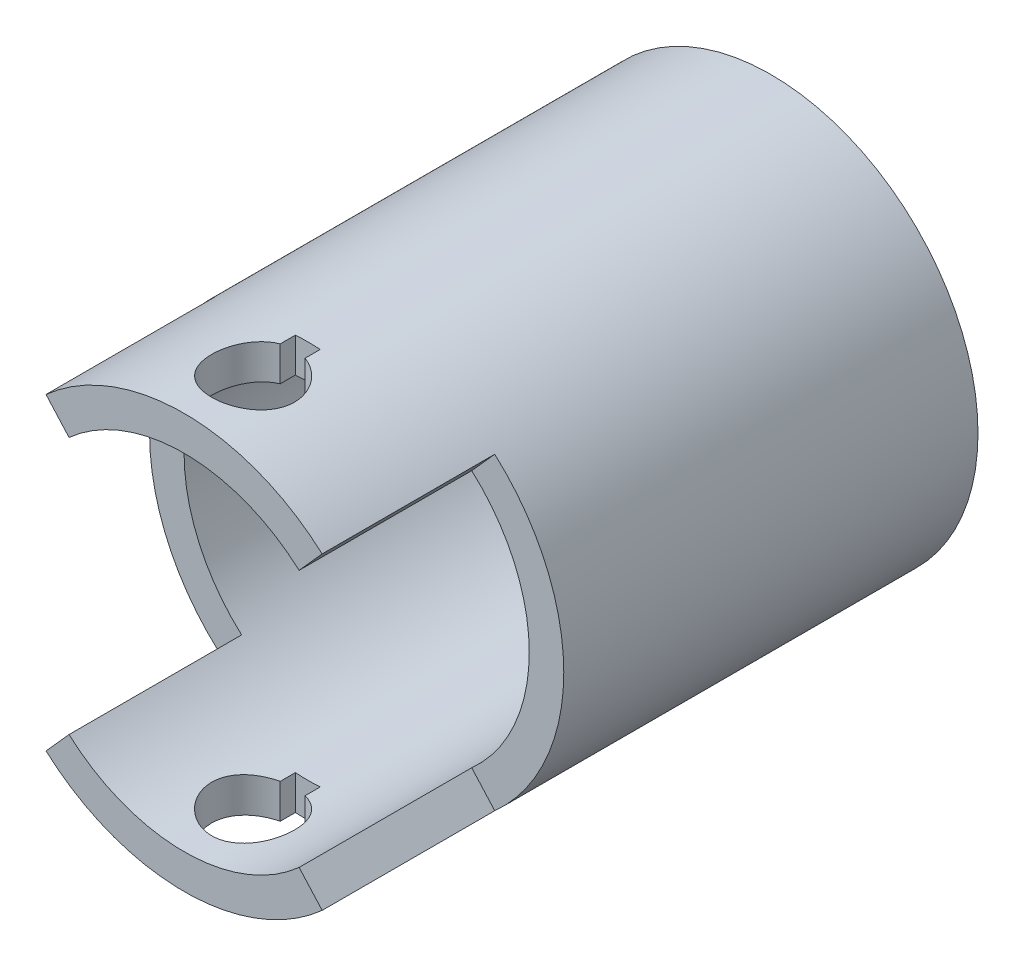
ISO-10303-21;
HEADER;
FILE_DESCRIPTION(('STEP AP214'),'2;1');
FILE_NAME('part.step','',(''),(''),'','','');
FILE_SCHEMA(('AUTOMOTIVE_DESIGN { 1 0 10303 214 1 1 1 1 }'));
ENDSEC;
DATA;
#1=APPLICATION_CONTEXT('core data for automotive mechanical design processes');
#2=APPLICATION_PROTOCOL_DEFINITION('international standard','automotive_design',2000,#1);
#3=PRODUCT_CONTEXT('',#1,'mechanical');
#4=PRODUCT('Part','Part','',(#3));
#5=PRODUCT_RELATED_PRODUCT_CATEGORY('part','',(#4));
#6=PRODUCT_DEFINITION_FORMATION('','',#4);
#7=PRODUCT_DEFINITION_CONTEXT('part definition',#1,'design');
#8=PRODUCT_DEFINITION('design','',#6,#7);
#9=PRODUCT_DEFINITION_SHAPE('','',#8);
#10=(LENGTH_UNIT() NAMED_UNIT(*) SI_UNIT(.MILLI.,.METRE.));
#11=(NAMED_UNIT(*) PLANE_ANGLE_UNIT() SI_UNIT($,.RADIAN.));
#12=(NAMED_UNIT(*) SI_UNIT($,.STERADIAN.) SOLID_ANGLE_UNIT());
#13=UNCERTAINTY_MEASURE_WITH_UNIT(LENGTH_MEASURE(1.E-05),#10,'distance_accuracy_value','');
#14=(GEOMETRIC_REPRESENTATION_CONTEXT(3) GLOBAL_UNCERTAINTY_ASSIGNED_CONTEXT((#13)) GLOBAL_UNIT_ASSIGNED_CONTEXT((#10,
#11,#12)) REPRESENTATION_CONTEXT('',''));
#15=CARTESIAN_POINT('',(0.,0.,0.));
#16=DIRECTION('',(0.,0.,1.));
#17=DIRECTION('',(1.,0.,0.));
#18=AXIS2_PLACEMENT_3D('',#15,#16,#17);
#19=CARTESIAN_POINT('',(0.,0.,30.));
#20=DIRECTION('',(0.,0.,1.));
#21=DIRECTION('',(1.,0.,0.));
#22=AXIS2_PLACEMENT_3D('',#19,#20,#21);
#23=PLANE('',#22);
#24=DIRECTION('',(0.666666666666667,0.74535599249993,0.));
#25=VECTOR('',#24,1.);
#26=CARTESIAN_POINT('',(10.,11.1803398874989,30.));
#27=LINE('',#26,#25);
#28=CARTESIAN_POINT('',(8.33333333333334,9.31694990624912,30.));
#29=VERTEX_POINT('',#28);
#30=CARTESIAN_POINT('',(10.,11.180339887499,30.));
#31=VERTEX_POINT('',#30);
#32=EDGE_CURVE('E200',#29,#31,#27,.T.);
#33=ORIENTED_EDGE('',*,*,#32,.F.);
#34=CARTESIAN_POINT('',(0.,0.,30.));
#35=DIRECTION('',(0.,0.,1.));
#36=DIRECTION('',(1.,0.,0.));
#37=AXIS2_PLACEMENT_3D('',#34,#35,#36);
#38=CIRCLE('',#37,12.5);
#39=CARTESIAN_POINT('',(8.33333333333333,-9.31694990624912,30.));
#40=VERTEX_POINT('',#39);
#41=EDGE_CURVE('E265',#40,#29,#38,.T.);
#42=ORIENTED_EDGE('',*,*,#41,.F.);
#43=DIRECTION('',(-0.666666666666667,0.74535599249993,0.));
#44=VECTOR('',#43,1.);
#45=CARTESIAN_POINT('',(10.,-11.1803398874989,30.));
#46=LINE('',#45,#44);
#47=CARTESIAN_POINT('',(10.,-11.180339887499,30.));
#48=VERTEX_POINT('',#47);
#49=EDGE_CURVE('E214',#48,#40,#46,.T.);
#50=ORIENTED_EDGE('',*,*,#49,.F.);
#51=CARTESIAN_POINT('',(0.,0.,30.));
#52=DIRECTION('',(0.,0.,1.));
#53=DIRECTION('',(1.,0.,0.));
#54=AXIS2_PLACEMENT_3D('',#51,#52,#53);
#55=CIRCLE('',#54,15.);
#56=EDGE_CURVE('E273',#48,#31,#55,.T.);
#57=ORIENTED_EDGE('',*,*,#56,.T.);
#58=EDGE_LOOP('',(#33,#42,#50,#57));
#59=FACE_BOUND('',#58,.T.);
#60=ADVANCED_FACE('F47',(#59),#23,.T.);
#61=DIRECTION('',(0.666666666666666,-0.74535599249993,0.));
#62=VECTOR('',#61,1.);
#63=CARTESIAN_POINT('',(-10.,11.1803398874989,30.));
#64=LINE('',#63,#62);
#65=CARTESIAN_POINT('',(-10.,11.1803398874989,30.));
#66=VERTEX_POINT('',#65);
#67=CARTESIAN_POINT('',(-8.33333333333334,9.31694990624912,30.));
#68=VERTEX_POINT('',#67);
#69=EDGE_CURVE('E210',#66,#68,#64,.T.);
#70=ORIENTED_EDGE('',*,*,#69,.F.);
#71=CARTESIAN_POINT('',(-10.,-11.1803398874989,30.));
#72=VERTEX_POINT('',#71);
#73=EDGE_CURVE('E276',#66,#72,#55,.T.);
#74=ORIENTED_EDGE('',*,*,#73,.T.);
#75=DIRECTION('',(-0.666666666666666,-0.74535599249993,0.));
#76=VECTOR('',#75,1.);
#77=CARTESIAN_POINT('',(-10.,-11.1803398874989,30.));
#78=LINE('',#77,#76);
#79=CARTESIAN_POINT('',(-8.33333333333334,-9.31694990624912,30.));
#80=VERTEX_POINT('',#79);
#81=EDGE_CURVE('E246',#80,#72,#78,.T.);
#82=ORIENTED_EDGE('',*,*,#81,.F.);
#83=EDGE_CURVE('E269',#68,#80,#38,.T.);
#84=ORIENTED_EDGE('',*,*,#83,.F.);
#85=EDGE_LOOP('',(#70,#74,#82,#84));
#86=FACE_BOUND('',#85,.T.);
#87=ADVANCED_FACE('F397',(#86),#23,.T.);
#88=CARTESIAN_POINT('',(0.,0.,0.));
#89=DIRECTION('',(0.,0.,1.));
#90=DIRECTION('',(1.,0.,0.));
#91=AXIS2_PLACEMENT_3D('',#88,#89,#90);
#92=PLANE('',#91);
#93=CARTESIAN_POINT('',(0.,0.,0.));
#94=DIRECTION('',(0.,0.,1.));
#95=DIRECTION('',(1.,0.,0.));
#96=AXIS2_PLACEMENT_3D('',#93,#94,#95);
#97=CIRCLE('',#96,15.);
#98=CARTESIAN_POINT('',(15.,0.,0.));
#99=VERTEX_POINT('',#98);
#100=EDGE_CURVE('E277',#99,#99,#97,.T.);
#101=ORIENTED_EDGE('',*,*,#100,.F.);
#102=EDGE_LOOP('',(#101));
#103=FACE_BOUND('',#102,.T.);
#104=CARTESIAN_POINT('',(0.,0.,0.));
#105=DIRECTION('',(0.,0.,1.));
#106=DIRECTION('',(1.,0.,0.));
#107=AXIS2_PLACEMENT_3D('',#104,#105,#106);
#108=CIRCLE('',#107,12.5);
#109=CARTESIAN_POINT('',(12.5,0.,0.));
#110=VERTEX_POINT('',#109);
#111=EDGE_CURVE('E232',#110,#110,#108,.T.);
#112=ORIENTED_EDGE('',*,*,#111,.T.);
#113=EDGE_LOOP('',(#112));
#114=FACE_BOUND('',#113,.T.);
#115=ADVANCED_FACE('F403',(#103,#114),#92,.F.);
#116=CARTESIAN_POINT('',(0.,0.,30.));
#117=DIRECTION('',(0.,0.,-1.));
#118=DIRECTION('',(-1.,0.,0.));
#119=AXIS2_PLACEMENT_3D('',#116,#117,#118);
#120=CYLINDRICAL_SURFACE('',#119,15.);
#121=CARTESIAN_POINT('',(-0.899999999999991,-14.9729756561613,34.6381823957492));
#122=CARTESIAN_POINT('',(-0.980655268019573,-14.9681328049606,34.6635388645008));
#123=CARTESIAN_POINT('',(-1.06019389196661,-14.9626926987928,34.6923076292037));
#124=CARTESIAN_POINT('',(-1.21648823193344,-14.9507945355664,34.7564115717083));
#125=CARTESIAN_POINT('',(-1.29324433924086,-14.9443366223238,34.7917458219331));
#126=CARTESIAN_POINT('',(-1.44337212889856,-14.9305848050696,34.8686914325859));
#127=CARTESIAN_POINT('',(-1.51674711344037,-14.9232917420677,34.9102964913302));
#128=CARTESIAN_POINT('',(-1.65967459235491,-14.9080733817031,34.9994829685327));
#129=CARTESIAN_POINT('',(-1.72922703092511,-14.9001480751149,35.0470644742032));
#130=CARTESIAN_POINT('',(-1.93144019722686,-14.8757493328797,35.1983028052586));
#131=CARTESIAN_POINT('',(-2.05778247693432,-14.8586409995706,35.3105180648826));
#132=CARTESIAN_POINT('',(-2.28983159190748,-14.8246582090057,35.5544786815639));
#133=CARTESIAN_POINT('',(-2.39553880470616,-14.8077837474764,35.6862236812333));
#134=CARTESIAN_POINT('',(-2.58413515889965,-14.7760437239309,35.9667107068343));
#135=CARTESIAN_POINT('',(-2.66686573140919,-14.7611924659785,36.1155612909484));
#136=CARTESIAN_POINT('',(-2.80607734841753,-14.7353648594891,36.4253953899722));
#137=CARTESIAN_POINT('',(-2.86255825369075,-14.7243885315045,36.5863789692288));
#138=CARTESIAN_POINT('',(-2.94698380971086,-14.7077235383515,36.9138793193003));
#139=CARTESIAN_POINT('',(-2.97526076417683,-14.7019733711604,37.0803071999752));
#140=CARTESIAN_POINT('',(-3.00352852726525,-14.6962251913254,37.4156306902891));
#141=CARTESIAN_POINT('',(-3.00352367707613,-14.6962262958752,37.5845259172163));
#142=CARTESIAN_POINT('',(-2.97546739984133,-14.7019312346246,37.9171440045459));
#143=CARTESIAN_POINT('',(-2.94786291338032,-14.7075441920595,38.0809063998905));
#144=CARTESIAN_POINT('',(-2.86614622279458,-14.7236857824962,38.4014220943643));
#145=CARTESIAN_POINT('',(-2.81203259322414,-14.7342146798358,38.5581750160865));
#146=CARTESIAN_POINT('',(-2.6785694888077,-14.7590606321949,38.8611822422004));
#147=CARTESIAN_POINT('',(-2.59909054625977,-14.7733970568806,39.0073778604002));
#148=CARTESIAN_POINT('',(-2.41723368105998,-14.8042379272796,39.2845047693255));
#149=CARTESIAN_POINT('',(-2.31485322422644,-14.8207426128398,39.415434368339));
#150=CARTESIAN_POINT('',(-2.0878910562565,-14.8544296011563,39.660820252272));
#151=CARTESIAN_POINT('',(-1.96293979842515,-14.8716187670055,39.7749340474476));
#152=CARTESIAN_POINT('',(-1.69552471037375,-14.9044729416879,39.9806560776456));
#153=CARTESIAN_POINT('',(-1.55306043299695,-14.9201379115857,40.0722637378437));
#154=CARTESIAN_POINT('',(-1.25402233574952,-14.9482448093784,40.2305927173542));
#155=CARTESIAN_POINT('',(-1.09740525398656,-14.9606763713043,40.2972342914875));
#156=CARTESIAN_POINT('',(-0.774893396556592,-14.9808415891407,40.4031602356551));
#157=CARTESIAN_POINT('',(-0.608999718554731,-14.9885757995922,40.4424478350148));
#158=CARTESIAN_POINT('',(-0.275519001636917,-14.998381934318,40.4919968856149));
#159=CARTESIAN_POINT('',(-0.108002833765448,-15.0005434823916,40.502717862776));
#160=CARTESIAN_POINT('',(0.226445623401845,-14.999222705133,40.4961129654795));
#161=CARTESIAN_POINT('',(0.393377950096537,-14.9957407481948,40.478788921732));
#162=CARTESIAN_POINT('',(0.720139649048265,-14.9835868125,40.4169791708555));
#163=CARTESIAN_POINT('',(0.880024450022681,-14.9749686289823,40.3727749026181));
#164=CARTESIAN_POINT('',(1.19009925128281,-14.953522610448,40.2587957363784));
#165=CARTESIAN_POINT('',(1.34028858908467,-14.9406944881328,40.1890190932049));
#166=CARTESIAN_POINT('',(1.62855881528499,-14.9120432117228,40.0249955271727));
#167=CARTESIAN_POINT('',(1.76648695173606,-14.8961884208283,39.930485813961));
#168=CARTESIAN_POINT('',(2.02469517050237,-14.8632964223305,39.7199913784699));
#169=CARTESIAN_POINT('',(2.14497332527311,-14.846259085881,39.6040043137851));
#170=CARTESIAN_POINT('',(2.36644432790676,-14.8125863875012,39.3516394605755));
#171=CARTESIAN_POINT('',(2.46730233649854,-14.7959617643762,39.2149660715195));
#172=CARTESIAN_POINT('',(2.64465065914605,-14.7652955937237,38.9263611273685));
#173=CARTESIAN_POINT('',(2.72114150252875,-14.751253990088,38.7744299038132));
#174=CARTESIAN_POINT('',(2.84723456252328,-14.7274364126355,38.4601144374416));
#175=CARTESIAN_POINT('',(2.89693434997246,-14.7176449857586,38.2977705683252));
#176=CARTESIAN_POINT('',(2.96828747972381,-14.7034218365661,37.9668135099487));
#177=CARTESIAN_POINT('',(2.98994499484848,-14.6989893168264,37.7982012572959));
#178=CARTESIAN_POINT('',(3.00437721849506,-14.6960460007528,37.4627787467192));
#179=CARTESIAN_POINT('',(2.99767042188113,-14.6974288969488,37.2959915438637));
#180=CARTESIAN_POINT('',(2.95676416267464,-14.7057122426132,36.9659645697246));
#181=CARTESIAN_POINT('',(2.92256418693077,-14.7126127950668,36.8027248647123));
#182=CARTESIAN_POINT('',(2.82794000784992,-14.7310911454113,36.4850537944596));
#183=CARTESIAN_POINT('',(2.76762286382272,-14.7426498354378,36.3305893510207));
#184=CARTESIAN_POINT('',(2.62256776172642,-14.7691417913021,36.0339135382083));
#185=CARTESIAN_POINT('',(2.53782872601073,-14.7840752060477,35.8917027099007));
#186=CARTESIAN_POINT('',(2.34468558901658,-14.8159426237053,35.6210259679321));
#187=CARTESIAN_POINT('',(2.2359140165942,-14.832905575596,35.4928256221344));
#188=CARTESIAN_POINT('',(1.99852944088484,-14.8667491127533,35.2563522685725));
#189=CARTESIAN_POINT('',(1.86991714654904,-14.8836297009407,35.1480785490906));
#190=CARTESIAN_POINT('',(1.60623332242644,-14.9142978398231,34.9614684084967));
#191=CARTESIAN_POINT('',(1.47231940927307,-14.928221243453,34.8815231536747));
#192=CARTESIAN_POINT('',(1.26330390740571,-14.9468720721084,34.7778434666382));
#193=CARTESIAN_POINT('',(1.19223581425495,-14.9527190776951,34.7459776784128));
#194=CARTESIAN_POINT('',(1.04776897901279,-14.9635370137866,34.6878406388594));
#195=CARTESIAN_POINT('',(0.974369851569051,-14.9685077985408,34.6615703181303));
#196=CARTESIAN_POINT('',(0.899999999999993,-14.9729756561613,34.6381823957492));
#197=B_SPLINE_CURVE_WITH_KNOTS('',3,(#121,#122,#123,#124,#125,#126,#127,#128,#129,#130,#131,
#132,#133,#134,#135,#136,#137,#138,#139,#140,#141,#142,#143,#144,#145,#146,#147,#148,#149,#150,
#151,#152,#153,#154,#155,#156,#157,#158,#159,#160,#161,#162,#163,#164,#165,#166,#167,#168,#169,
#170,#171,#172,#173,#174,#175,#176,#177,#178,#179,#180,#181,#182,#183,#184,#185,#186,#187,#188,
#189,#190,#191,#192,#193,#194,#195,#196),.UNSPECIFIED.,.F.,.F.,(4,2,2,2,2,2,2,2,2,2,2,2,2,2,2,2,
2,2,2,2,2,2,2,2,2,2,2,2,2,2,2,2,2,2,2,2,2,4),(0.,0.253967487661169,0.50789912184486,
0.761577254863195,1.0152590901583,1.52220252376998,2.02913668162746,2.53948701235611,
3.04984004990009,3.55410636189237,4.0582952702306,4.55444961999749,5.05063065183132,
5.54938588339812,6.04819633236861,6.55606883655528,7.06395431085295,7.57344848426295,
8.0828824981672,8.58407078537549,9.08522635756287,9.58122301677758,10.0772535312836,
10.5787849516591,11.080371103299,11.58995382438,12.0995254750605,12.6072285495908,
13.1148560668214,13.6132447339801,14.1116427036179,14.6080167034535,15.1044126097686,
15.6090006604521,16.1135706853055,16.5812927544651,16.8153957809097,17.0495377113771),.UNSPECIFIED.);
#198=CARTESIAN_POINT('',(-0.899999999999991,-14.9729756561613,34.6381823957492));
#199=VERTEX_POINT('',#198);
#200=CARTESIAN_POINT('',(0.899999999999995,-14.9729756561613,34.6381823957492));
#201=VERTEX_POINT('',#200);
#202=EDGE_CURVE('E180',#199,#201,#197,.T.);
#203=ORIENTED_EDGE('',*,*,#202,.T.);
#204=DIRECTION('',(0.,0.,-1.));
#205=VECTOR('',#204,1.);
#206=CARTESIAN_POINT('',(0.899999999999993,-14.9729756561613,30.));
#207=LINE('',#206,#205);
#208=CARTESIAN_POINT('',(0.899999999999995,-14.9729756561613,33.5381823957492));
#209=VERTEX_POINT('',#208);
#210=EDGE_CURVE('E170',#201,#209,#207,.T.);
#211=ORIENTED_EDGE('',*,*,#210,.T.);
#212=CARTESIAN_POINT('',(0.,0.,33.5381823957492));
#213=DIRECTION('',(0.,0.,-1.));
#214=DIRECTION('',(0.,1.,0.));
#215=AXIS2_PLACEMENT_3D('',#212,#213,#214);
#216=CIRCLE('',#215,15.);
#217=CARTESIAN_POINT('',(-0.900000000000005,-14.9729756561613,33.5381823957492));
#218=VERTEX_POINT('',#217);
#219=EDGE_CURVE('E158',#209,#218,#216,.T.);
#220=ORIENTED_EDGE('',*,*,#219,.T.);
#221=DIRECTION('',(0.,0.,-1.));
#222=VECTOR('',#221,1.);
#223=CARTESIAN_POINT('',(-0.900000000000052,-14.9729756561613,30.));
#224=LINE('',#223,#222);
#225=EDGE_CURVE('E164',#218,#199,#224,.F.);
#226=ORIENTED_EDGE('',*,*,#225,.T.);
#227=EDGE_LOOP('',(#203,#211,#220,#226));
#228=FACE_BOUND('',#227,.T.);
#229=CARTESIAN_POINT('',(-0.900000000000007,14.9729756561613,33.5381823957492));
#230=VERTEX_POINT('',#229);
#231=CARTESIAN_POINT('',(0.899999999999993,14.9729756561613,33.5381823957492));
#232=VERTEX_POINT('',#231);
#233=EDGE_CURVE('E165',#230,#232,#216,.T.);
#234=ORIENTED_EDGE('',*,*,#233,.T.);
#235=DIRECTION('',(0.,0.,-1.));
#236=VECTOR('',#235,1.);
#237=CARTESIAN_POINT('',(0.899999999999991,14.9729756561613,30.));
#238=LINE('',#237,#236);
#239=CARTESIAN_POINT('',(0.899999999999993,14.9729756561613,34.6381823957492));
#240=VERTEX_POINT('',#239);
#241=EDGE_CURVE('E183',#232,#240,#238,.F.);
#242=ORIENTED_EDGE('',*,*,#241,.T.);
#243=CARTESIAN_POINT('',(0.899999999999993,14.9729756561613,34.6381823957492));
#244=CARTESIAN_POINT('',(0.980655268019578,14.9681328049606,34.6635388645008));
#245=CARTESIAN_POINT('',(1.06019389196662,14.9626926987928,34.6923076292037));
#246=CARTESIAN_POINT('',(1.21648823193345,14.9507945355664,34.7564115717083));
#247=CARTESIAN_POINT('',(1.29324433924087,14.9443366223238,34.7917458219331));
#248=CARTESIAN_POINT('',(1.44337212889857,14.9305848050696,34.8686914325859));
#249=CARTESIAN_POINT('',(1.51674711344038,14.9232917420677,34.9102964913302));
#250=CARTESIAN_POINT('',(1.65967459235492,14.9080733817031,34.9994829685327));
#251=CARTESIAN_POINT('',(1.72922703092512,14.9001480751149,35.0470644742033));
#252=CARTESIAN_POINT('',(1.93144019722686,14.8757493328797,35.1983028052586));
#253=CARTESIAN_POINT('',(2.05778247693433,14.8586409995706,35.3105180648826));
#254=CARTESIAN_POINT('',(2.28983159190749,14.8246582090057,35.5544786815639));
#255=CARTESIAN_POINT('',(2.39553880470616,14.8077837474764,35.6862236812334));
#256=CARTESIAN_POINT('',(2.58413515889965,14.7760437239309,35.9667107068343));
#257=CARTESIAN_POINT('',(2.6668657314092,14.7611924659785,36.1155612909484));
#258=CARTESIAN_POINT('',(2.80607734841753,14.7353648594891,36.4253953899722));
#259=CARTESIAN_POINT('',(2.86255825369074,14.7243885315045,36.5863789692288));
#260=CARTESIAN_POINT('',(2.94698380971086,14.7077235383515,36.9138793193003));
#261=CARTESIAN_POINT('',(2.97526076417683,14.7019733711604,37.0803071999752));
#262=CARTESIAN_POINT('',(3.00352852726524,14.6962251913254,37.4156306902891));
#263=CARTESIAN_POINT('',(3.00352367707612,14.6962262958752,37.5845259172163));
#264=CARTESIAN_POINT('',(2.97546739984133,14.7019312346246,37.9171440045459));
#265=CARTESIAN_POINT('',(2.94786291338031,14.7075441920595,38.0809063998905));
#266=CARTESIAN_POINT('',(2.86614622279457,14.7236857824962,38.4014220943643));
#267=CARTESIAN_POINT('',(2.81203259322413,14.7342146798358,38.5581750160865));
#268=CARTESIAN_POINT('',(2.67856948880769,14.7590606321949,38.8611822422005));
#269=CARTESIAN_POINT('',(2.59909054625976,14.7733970568806,39.0073778604002));
#270=CARTESIAN_POINT('',(2.41723368105996,14.8042379272796,39.2845047693255));
#271=CARTESIAN_POINT('',(2.31485322422643,14.8207426128398,39.415434368339));
#272=CARTESIAN_POINT('',(2.08789105625649,14.8544296011563,39.660820252272));
#273=CARTESIAN_POINT('',(1.96293979842513,14.8716187670055,39.7749340474476));
#274=CARTESIAN_POINT('',(1.69552471037373,14.9044729416879,39.9806560776456));
#275=CARTESIAN_POINT('',(1.55306043299694,14.9201379115857,40.0722637378437));
#276=CARTESIAN_POINT('',(1.2540223357495,14.9482448093784,40.2305927173543));
#277=CARTESIAN_POINT('',(1.09740525398655,14.9606763713043,40.2972342914875));
#278=CARTESIAN_POINT('',(0.774893396556574,14.9808415891407,40.4031602356551));
#279=CARTESIAN_POINT('',(0.608999718554714,14.9885757995922,40.4424478350148));
#280=CARTESIAN_POINT('',(0.275519001636901,14.998381934318,40.4919968856149));
#281=CARTESIAN_POINT('',(0.108002833765432,15.0005434823916,40.502717862776));
#282=CARTESIAN_POINT('',(-0.226445623401861,14.999222705133,40.4961129654795));
#283=CARTESIAN_POINT('',(-0.393377950096553,14.9957407481948,40.478788921732));
#284=CARTESIAN_POINT('',(-0.720139649048282,14.9835868125,40.4169791708555));
#285=CARTESIAN_POINT('',(-0.8800244500227,14.9749686289823,40.3727749026181));
#286=CARTESIAN_POINT('',(-1.19009925128283,14.953522610448,40.2587957363783));
#287=CARTESIAN_POINT('',(-1.34028858908469,14.9406944881328,40.1890190932049));
#288=CARTESIAN_POINT('',(-1.62855881528501,14.9120432117228,40.0249955271727));
#289=CARTESIAN_POINT('',(-1.76648695173608,14.8961884208283,39.930485813961));
#290=CARTESIAN_POINT('',(-2.02469517050238,14.8632964223305,39.7199913784699));
#291=CARTESIAN_POINT('',(-2.14497332527312,14.8462590858809,39.6040043137851));
#292=CARTESIAN_POINT('',(-2.36644432790677,14.8125863875012,39.3516394605755));
#293=CARTESIAN_POINT('',(-2.46730233649855,14.7959617643762,39.2149660715195));
#294=CARTESIAN_POINT('',(-2.64465065914606,14.7652955937237,38.9263611273685));
#295=CARTESIAN_POINT('',(-2.72114150252876,14.751253990088,38.7744299038131));
#296=CARTESIAN_POINT('',(-2.84723456252329,14.7274364126355,38.4601144374416));
#297=CARTESIAN_POINT('',(-2.89693434997247,14.7176449857586,38.2977705683251));
#298=CARTESIAN_POINT('',(-2.96828747972382,14.7034218365661,37.9668135099486));
#299=CARTESIAN_POINT('',(-2.98994499484848,14.6989893168264,37.7982012572959));
#300=CARTESIAN_POINT('',(-3.00437721849506,14.6960460007528,37.4627787467192));
#301=CARTESIAN_POINT('',(-2.99767042188113,14.6974288969488,37.2959915438637));
#302=CARTESIAN_POINT('',(-2.95676416267464,14.7057122426132,36.9659645697246));
#303=CARTESIAN_POINT('',(-2.92256418693077,14.7126127950668,36.8027248647123));
#304=CARTESIAN_POINT('',(-2.82794000784991,14.7310911454113,36.4850537944596));
#305=CARTESIAN_POINT('',(-2.76762286382272,14.7426498354378,36.3305893510207));
#306=CARTESIAN_POINT('',(-2.62256776172642,14.7691417913021,36.0339135382083));
#307=CARTESIAN_POINT('',(-2.53782872601072,14.7840752060477,35.8917027099007));
#308=CARTESIAN_POINT('',(-2.34468558901657,14.8159426237053,35.6210259679321));
#309=CARTESIAN_POINT('',(-2.2359140165942,14.832905575596,35.4928256221343));
#310=CARTESIAN_POINT('',(-1.99852944088483,14.8667491127533,35.2563522685724));
#311=CARTESIAN_POINT('',(-1.86991714654903,14.8836297009407,35.1480785490906));
#312=CARTESIAN_POINT('',(-1.60623332242643,14.9142978398231,34.9614684084967));
#313=CARTESIAN_POINT('',(-1.47231940927306,14.928221243453,34.8815231536747));
#314=CARTESIAN_POINT('',(-1.2633039074057,14.9468720721084,34.7778434666382));
#315=CARTESIAN_POINT('',(-1.19223581425495,14.9527190776951,34.7459776784128));
#316=CARTESIAN_POINT('',(-1.0477689790128,14.9635370137866,34.6878406388594));
#317=CARTESIAN_POINT('',(-0.974369851569056,14.9685077985408,34.6615703181303));
#318=CARTESIAN_POINT('',(-0.899999999999996,14.9729756561613,34.6381823957492));
#319=B_SPLINE_CURVE_WITH_KNOTS('',3,(#243,#244,#245,#246,#247,#248,#249,#250,#251,#252,#253,
#254,#255,#256,#257,#258,#259,#260,#261,#262,#263,#264,#265,#266,#267,#268,#269,#270,#271,#272,
#273,#274,#275,#276,#277,#278,#279,#280,#281,#282,#283,#284,#285,#286,#287,#288,#289,#290,#291,
#292,#293,#294,#295,#296,#297,#298,#299,#300,#301,#302,#303,#304,#305,#306,#307,#308,#309,#310,
#311,#312,#313,#314,#315,#316,#317,#318),.UNSPECIFIED.,.F.,.F.,(4,2,2,2,2,2,2,2,2,2,2,2,2,2,2,2,
2,2,2,2,2,2,2,2,2,2,2,2,2,2,2,2,2,2,2,2,2,4),(0.,0.253967487661172,0.50789912184487,
0.761577254863204,1.01525909015831,1.52220252376999,2.02913668162748,2.53948701235612,
3.04984004990009,3.55410636189238,4.0582952702306,4.5544496199975,5.05063065183132,
5.54938588339812,6.04819633236861,6.5560688365553,7.06395431085296,7.57344848426296,
8.0828824981672,8.5840707853755,9.08522635756288,9.58122301677759,10.0772535312836,
10.5787849516591,11.080371103299,11.58995382438,12.0995254750605,12.6072285495908,
13.1148560668214,13.61324473398,14.1116427036179,14.6080167034535,15.1044126097687,
15.6090006604521,16.1135706853055,16.5812927544651,16.8153957809097,17.0495377113771),.UNSPECIFIED.);
#320=CARTESIAN_POINT('',(-0.899999999999993,14.9729756561613,34.6381823957492));
#321=VERTEX_POINT('',#320);
#322=EDGE_CURVE('E191',#240,#321,#319,.T.);
#323=ORIENTED_EDGE('',*,*,#322,.T.);
#324=DIRECTION('',(0.,0.,-1.));
#325=VECTOR('',#324,1.);
#326=CARTESIAN_POINT('',(-0.900000000000053,14.9729756561613,30.));
#327=LINE('',#326,#325);
#328=EDGE_CURVE('E327',#321,#230,#327,.T.);
#329=ORIENTED_EDGE('',*,*,#328,.T.);
#330=EDGE_LOOP('',(#234,#242,#323,#329));
#331=FACE_BOUND('',#330,.T.);
#332=ORIENTED_EDGE('',*,*,#73,.F.);
#333=DIRECTION('',(0.,0.,-1.));
#334=VECTOR('',#333,1.);
#335=CARTESIAN_POINT('',(-10.,11.1803398874989,42.5));
#336=LINE('',#335,#334);
#337=CARTESIAN_POINT('',(-10.,11.1803398874989,42.5));
#338=VERTEX_POINT('',#337);
#339=EDGE_CURVE('E229',#338,#66,#336,.T.);
#340=ORIENTED_EDGE('',*,*,#339,.F.);
#341=CARTESIAN_POINT('',(0.,0.,42.5));
#342=DIRECTION('',(0.,0.,1.));
#343=DIRECTION('',(-1.,0.,0.));
#344=AXIS2_PLACEMENT_3D('',#341,#342,#343);
#345=CIRCLE('',#344,15.);
#346=CARTESIAN_POINT('',(10.,11.1803398874989,42.5));
#347=VERTEX_POINT('',#346);
#348=EDGE_CURVE('E195',#347,#338,#345,.T.);
#349=ORIENTED_EDGE('',*,*,#348,.F.);
#350=DIRECTION('',(0.,0.,-1.));
#351=VECTOR('',#350,1.);
#352=CARTESIAN_POINT('',(10.,11.1803398874989,42.5));
#353=LINE('',#352,#351);
#354=EDGE_CURVE('E209',#347,#31,#353,.T.);
#355=ORIENTED_EDGE('',*,*,#354,.T.);
#356=ORIENTED_EDGE('',*,*,#56,.F.);
#357=DIRECTION('',(0.,0.,-1.));
#358=VECTOR('',#357,1.);
#359=CARTESIAN_POINT('',(10.,-11.1803398874989,42.5));
#360=LINE('',#359,#358);
#361=CARTESIAN_POINT('',(10.,-11.1803398874989,42.5));
#362=VERTEX_POINT('',#361);
#363=EDGE_CURVE('E182',#362,#48,#360,.T.);
#364=ORIENTED_EDGE('',*,*,#363,.F.);
#365=CARTESIAN_POINT('',(0.,0.,42.5));
#366=DIRECTION('',(0.,0.,1.));
#367=DIRECTION('',(1.,0.,0.));
#368=AXIS2_PLACEMENT_3D('',#365,#366,#367);
#369=CIRCLE('',#368,15.);
#370=CARTESIAN_POINT('',(-10.,-11.1803398874989,42.5));
#371=VERTEX_POINT('',#370);
#372=EDGE_CURVE('E250',#371,#362,#369,.T.);
#373=ORIENTED_EDGE('',*,*,#372,.F.);
#374=DIRECTION('',(0.,0.,-1.));
#375=VECTOR('',#374,1.);
#376=CARTESIAN_POINT('',(-10.,-11.1803398874989,42.5));
#377=LINE('',#376,#375);
#378=EDGE_CURVE('E241',#371,#72,#377,.T.);
#379=ORIENTED_EDGE('',*,*,#378,.T.);
#380=EDGE_LOOP('',(#332,#340,#349,#355,#356,#364,#373,#379));
#381=FACE_BOUND('',#380,.T.);
#382=ORIENTED_EDGE('',*,*,#100,.T.);
#383=EDGE_LOOP('',(#382));
#384=FACE_BOUND('',#383,.T.);
#385=ADVANCED_FACE('F49',(#228,#331,#381,#384),#120,.T.);
#386=CARTESIAN_POINT('',(0.,0.,30.));
#387=DIRECTION('',(0.,0.,-1.));
#388=DIRECTION('',(-1.,0.,0.));
#389=AXIS2_PLACEMENT_3D('',#386,#387,#388);
#390=CYLINDRICAL_SURFACE('',#389,12.5);
#391=DIRECTION('',(0.,0.,-1.));
#392=VECTOR('',#391,1.);
#393=CARTESIAN_POINT('',(0.899999999999992,-12.467557900407,30.));
#394=LINE('',#393,#392);
#395=CARTESIAN_POINT('',(0.899999999999995,-12.467557900407,34.6381823957492));
#396=VERTEX_POINT('',#395);
#397=CARTESIAN_POINT('',(0.899999999999995,-12.467557900407,33.5381823957492));
#398=VERTEX_POINT('',#397);
#399=EDGE_CURVE('E11',#396,#398,#394,.T.);
#400=ORIENTED_EDGE('',*,*,#399,.F.);
#401=CARTESIAN_POINT('',(-0.899999999999991,-12.467557900407,34.6381823957492));
#402=CARTESIAN_POINT('',(-0.980723168218143,-12.4617369089469,34.6635602294921));
#403=CARTESIAN_POINT('',(-1.06031191649198,-12.4551974435387,34.6923510258002));
#404=CARTESIAN_POINT('',(-1.21667101768821,-12.4408935896756,34.7564915523463));
#405=CARTESIAN_POINT('',(-1.29344188186089,-12.4331294247862,34.7918400856941));
#406=CARTESIAN_POINT('',(-1.44355978626981,-12.4165953594923,34.8687946077454));
#407=CARTESIAN_POINT('',(-1.51691063356637,-12.4078266168734,34.9103934098461));
#408=CARTESIAN_POINT('',(-1.65977159216584,-12.3895258635347,34.9995486300507));
#409=CARTESIAN_POINT('',(-1.72928160227143,-12.3799938327201,35.0471052050206));
#410=CARTESIAN_POINT('',(-1.93132916646948,-12.3506450480426,35.1982199295796));
#411=CARTESIAN_POINT('',(-2.05753744138251,-12.3300579105287,35.3103018725526));
#412=CARTESIAN_POINT('',(-2.2893846490646,-12.2891270546319,35.5539674368323));
#413=CARTESIAN_POINT('',(-2.39502219359861,-12.2687833527644,35.6855523732623));
#414=CARTESIAN_POINT('',(-2.58386748739374,-12.2304137517372,35.9662152803405));
#415=CARTESIAN_POINT('',(-2.66684354006261,-12.2124127137319,36.1154531029978));
#416=CARTESIAN_POINT('',(-2.80643599486743,-12.1810948474823,36.4262525425439));
#417=CARTESIAN_POINT('',(-2.86305411556185,-12.1677777138575,36.587813355164));
#418=CARTESIAN_POINT('',(-2.94734199721287,-12.1476350319515,36.9157556631294));
#419=CARTESIAN_POINT('',(-2.97549091281554,-12.1407022166765,37.0820072170984));
#420=CARTESIAN_POINT('',(-3.00355650226247,-12.1337904042499,37.4170017532293));
#421=CARTESIAN_POINT('',(-3.00347868560074,-12.1338100500676,37.5857442427631));
#422=CARTESIAN_POINT('',(-2.97544094680492,-12.1407140635203,37.9167841977958));
#423=CARTESIAN_POINT('',(-2.94812789434351,-12.1474391681589,38.0791403657346));
#424=CARTESIAN_POINT('',(-2.86748361707184,-12.1667267193047,38.396889020493));
#425=CARTESIAN_POINT('',(-2.81415058564111,-12.1792895711358,38.5522810229583));
#426=CARTESIAN_POINT('',(-2.68260043050245,-12.2089397235906,38.8530733905253));
#427=CARTESIAN_POINT('',(-2.60419868782373,-12.2260604288377,38.9983895715995));
#428=CARTESIAN_POINT('',(-2.42485407858858,-12.2628886763426,39.2740144797919));
#429=CARTESIAN_POINT('',(-2.32390765366735,-12.2825966267585,39.4043208328907));
#430=CARTESIAN_POINT('',(-2.09918117124783,-12.3230184337791,39.6498503267927));
#431=CARTESIAN_POINT('',(-1.97486889698624,-12.3437451111169,39.7645847479522));
#432=CARTESIAN_POINT('',(-1.70856788767318,-12.3834118919969,39.9716894685047));
#433=CARTESIAN_POINT('',(-1.56657843315695,-12.4023519227671,40.0640588571856));
#434=CARTESIAN_POINT('',(-1.26798677261919,-12.4364330782257,40.2241582994209));
#435=CARTESIAN_POINT('',(-1.11131713972239,-12.4515553643007,40.2917668820392));
#436=CARTESIAN_POINT('',(-0.788393624370314,-12.4761621210741,40.399550980888));
#437=CARTESIAN_POINT('',(-0.622141396388347,-12.4856475618168,40.4397312174377));
#438=CARTESIAN_POINT('',(-0.288876103106646,-12.4977481686399,40.4907040475222));
#439=CARTESIAN_POINT('',(-0.121968823492799,-12.5005165924118,40.5021524108431));
#440=CARTESIAN_POINT('',(0.21139565842113,-12.4993234639263,40.4971811223199));
#441=CARTESIAN_POINT('',(0.377852901095092,-12.4953625368948,40.4807640594604));
#442=CARTESIAN_POINT('',(0.703003202984086,-12.4812616425403,40.4210793870662));
#443=CARTESIAN_POINT('',(0.861775218493352,-12.4712151303785,40.3782177014025));
#444=CARTESIAN_POINT('',(1.16985585904601,-12.4460976294792,40.2673535864297));
#445=CARTESIAN_POINT('',(1.31916364387091,-12.4310261953791,40.1993489286216));
#446=CARTESIAN_POINT('',(1.60661280045776,-12.397180298014,40.038955995435));
#447=CARTESIAN_POINT('',(1.74454884928598,-12.3783528043052,39.9462112429219));
#448=CARTESIAN_POINT('',(2.00313688405887,-12.3391481142451,39.739389214524));
#449=CARTESIAN_POINT('',(2.1237861098245,-12.3187706712075,39.6253085386309));
#450=CARTESIAN_POINT('',(2.34727244052244,-12.2781731112765,39.3758975228857));
#451=CARTESIAN_POINT('',(2.44963092179517,-12.2579676332366,39.2401352909069));
#452=CARTESIAN_POINT('',(2.63012980217915,-12.2205133450085,38.9529871601402));
#453=CARTESIAN_POINT('',(2.70827077521371,-12.2032644647571,38.8016016317174));
#454=CARTESIAN_POINT('',(2.83769111829355,-12.1738212207643,38.4880068965721));
#455=CARTESIAN_POINT('',(2.88907967480963,-12.1616063546094,38.3258447808328));
#456=CARTESIAN_POINT('',(2.9637646582951,-12.1436238068529,37.9948418655431));
#457=CARTESIAN_POINT('',(2.98706715059596,-12.1378547332685,37.8260025161133));
#458=CARTESIAN_POINT('',(3.00454328759784,-12.1335400484936,37.4912105257029));
#459=CARTESIAN_POINT('',(2.99946883524449,-12.1348079714265,37.3252991647283));
#460=CARTESIAN_POINT('',(2.96210790454892,-12.1439811823897,36.9967607379555));
#461=CARTESIAN_POINT('',(2.92982126532594,-12.1518865096608,36.8341336915803));
#462=CARTESIAN_POINT('',(2.83941770262604,-12.1733243257432,36.5178726946467));
#463=CARTESIAN_POINT('',(2.78148222701883,-12.1868172436241,36.3641840031525));
#464=CARTESIAN_POINT('',(2.64157502875873,-12.2179046355273,36.0686288197457));
#465=CARTESIAN_POINT('',(2.5596012866388,-12.2354994541268,35.9267633223921));
#466=CARTESIAN_POINT('',(2.37168142829805,-12.2733245539549,35.6552745402621));
#467=CARTESIAN_POINT('',(2.26521842652384,-12.2936069443433,35.5260161701007));
#468=CARTESIAN_POINT('',(2.03233770833499,-12.3342433732795,35.2869787823413));
#469=CARTESIAN_POINT('',(1.90591965901327,-12.3545974130172,35.1772000897847));
#470=CARTESIAN_POINT('',(1.6395188027325,-12.3927232417394,34.9823574072489));
#471=CARTESIAN_POINT('',(1.49992980418933,-12.4105449060995,34.8967680286542));
#472=CARTESIAN_POINT('',(1.28132307645328,-12.4343726409123,34.7861621860567));
#473=CARTESIAN_POINT('',(1.20685255963016,-12.4418359826104,34.7522362475726));
#474=CARTESIAN_POINT('',(1.05528517153076,-12.4556083218115,34.6905402655051));
#475=CARTESIAN_POINT('',(0.97818782114987,-12.4619171073852,34.6627713519021));
#476=CARTESIAN_POINT('',(0.899999999999996,-12.467557900407,34.6381823957492));
#477=B_SPLINE_CURVE_WITH_KNOTS('',3,(#401,#402,#403,#404,#405,#406,#407,#408,#409,#410,#411,
#412,#413,#414,#415,#416,#417,#418,#419,#420,#421,#422,#423,#424,#425,#426,#427,#428,#429,#430,
#431,#432,#433,#434,#435,#436,#437,#438,#439,#440,#441,#442,#443,#444,#445,#446,#447,#448,#449,
#450,#451,#452,#453,#454,#455,#456,#457,#458,#459,#460,#461,#462,#463,#464,#465,#466,#467,#468,
#469,#470,#471,#472,#473,#474,#475,#476),.UNSPECIFIED.,.F.,.F.,(4,2,2,2,2,2,2,2,2,2,2,2,2,2,2,2,
2,2,2,2,2,2,2,2,2,2,2,2,2,2,2,2,2,2,2,2,2,4),(0.,0.254361926322586,0.508677473183212,
0.76270281283267,1.01673484228349,1.52428587134962,2.03187114111156,2.54446676676028,
3.05702896607748,3.5608131935939,4.0644990889809,4.55650014096093,5.04853535844497,
5.54428103196399,6.04010500741693,6.54901206489593,7.0579398417691,7.56933188039049,
8.0806358880861,8.58015930601595,9.07963631562624,9.57163081828105,10.0636689383823,
10.5632203953833,11.0628515268601,11.5740835803228,12.0853035173272,12.5944202882622,
13.1034270930748,13.5990117670214,14.0945993709275,14.5867357035997,15.0789133927466,
15.5826280260247,16.086351063587,16.5781019865019,16.8243788232515,17.0707008211141),.UNSPECIFIED.);
#478=CARTESIAN_POINT('',(-0.899999999999991,-12.467557900407,34.6381823957492));
#479=VERTEX_POINT('',#478);
#480=EDGE_CURVE('E57',#479,#396,#477,.T.);
#481=ORIENTED_EDGE('',*,*,#480,.F.);
#482=DIRECTION('',(0.,0.,-1.));
#483=VECTOR('',#482,1.);
#484=CARTESIAN_POINT('',(-0.900000000000052,-12.467557900407,30.));
#485=LINE('',#484,#483);
#486=CARTESIAN_POINT('',(-0.900000000000005,-12.467557900407,33.5381823957492));
#487=VERTEX_POINT('',#486);
#488=EDGE_CURVE('E367',#487,#479,#485,.F.);
#489=ORIENTED_EDGE('',*,*,#488,.F.);
#490=CARTESIAN_POINT('',(0.,0.,33.5381823957492));
#491=DIRECTION('',(0.,0.,-1.));
#492=DIRECTION('',(0.,1.,0.));
#493=AXIS2_PLACEMENT_3D('',#490,#491,#492);
#494=CIRCLE('',#493,12.5);
#495=EDGE_CURVE('E285',#398,#487,#494,.T.);
#496=ORIENTED_EDGE('',*,*,#495,.F.);
#497=EDGE_LOOP('',(#400,#481,#489,#496));
#498=FACE_BOUND('',#497,.T.);
#499=DIRECTION('',(0.,0.,-1.));
#500=VECTOR('',#499,1.);
#501=CARTESIAN_POINT('',(0.899999999999991,12.467557900407,30.));
#502=LINE('',#501,#500);
#503=CARTESIAN_POINT('',(0.899999999999993,12.467557900407,33.5381823957492));
#504=VERTEX_POINT('',#503);
#505=CARTESIAN_POINT('',(0.899999999999993,12.467557900407,34.6381823957492));
#506=VERTEX_POINT('',#505);
#507=EDGE_CURVE('E298',#504,#506,#502,.F.);
#508=ORIENTED_EDGE('',*,*,#507,.F.);
#509=CARTESIAN_POINT('',(-0.900000000000007,12.467557900407,33.5381823957492));
#510=VERTEX_POINT('',#509);
#511=EDGE_CURVE('E281',#510,#504,#494,.T.);
#512=ORIENTED_EDGE('',*,*,#511,.F.);
#513=DIRECTION('',(0.,0.,-1.));
#514=VECTOR('',#513,1.);
#515=CARTESIAN_POINT('',(-0.900000000000053,12.467557900407,30.));
#516=LINE('',#515,#514);
#517=CARTESIAN_POINT('',(-0.899999999999992,12.467557900407,34.6381823957492));
#518=VERTEX_POINT('',#517);
#519=EDGE_CURVE('E284',#518,#510,#516,.T.);
#520=ORIENTED_EDGE('',*,*,#519,.F.);
#521=CARTESIAN_POINT('',(0.899999999999993,12.467557900407,34.6381823957492));
#522=CARTESIAN_POINT('',(0.980723168218147,12.4617369089469,34.6635602294921));
#523=CARTESIAN_POINT('',(1.06031191649198,12.4551974435387,34.6923510258002));
#524=CARTESIAN_POINT('',(1.21667101768822,12.4408935896756,34.7564915523463));
#525=CARTESIAN_POINT('',(1.29344188186089,12.4331294247862,34.7918400856941));
#526=CARTESIAN_POINT('',(1.44355978626981,12.4165953594923,34.8687946077454));
#527=CARTESIAN_POINT('',(1.51691063356638,12.4078266168734,34.9103934098461));
#528=CARTESIAN_POINT('',(1.65977159216585,12.3895258635347,34.9995486300507));
#529=CARTESIAN_POINT('',(1.72928160227143,12.3799938327201,35.0471052050206));
#530=CARTESIAN_POINT('',(1.93132916646948,12.3506450480426,35.1982199295797));
#531=CARTESIAN_POINT('',(2.05753744138252,12.3300579105287,35.3103018725526));
#532=CARTESIAN_POINT('',(2.2893846490646,12.2891270546319,35.5539674368323));
#533=CARTESIAN_POINT('',(2.39502219359862,12.2687833527644,35.6855523732624));
#534=CARTESIAN_POINT('',(2.58386748739375,12.2304137517372,35.9662152803405));
#535=CARTESIAN_POINT('',(2.66684354006261,12.2124127137319,36.1154531029978));
#536=CARTESIAN_POINT('',(2.80643599486743,12.1810948474823,36.4262525425439));
#537=CARTESIAN_POINT('',(2.86305411556185,12.1677777138575,36.5878133551641));
#538=CARTESIAN_POINT('',(2.94734199721287,12.1476350319515,36.9157556631295));
#539=CARTESIAN_POINT('',(2.97549091281553,12.1407022166765,37.0820072170984));
#540=CARTESIAN_POINT('',(3.00355650226246,12.1337904042499,37.4170017532293));
#541=CARTESIAN_POINT('',(3.00347868560074,12.1338100500676,37.5857442427631));
#542=CARTESIAN_POINT('',(2.97544094680492,12.1407140635203,37.9167841977958));
#543=CARTESIAN_POINT('',(2.94812789434351,12.1474391681589,38.0791403657346));
#544=CARTESIAN_POINT('',(2.86748361707183,12.1667267193047,38.396889020493));
#545=CARTESIAN_POINT('',(2.8141505856411,12.1792895711358,38.5522810229583));
#546=CARTESIAN_POINT('',(2.68260043050244,12.2089397235906,38.8530733905253));
#547=CARTESIAN_POINT('',(2.60419868782372,12.2260604288377,38.9983895715995));
#548=CARTESIAN_POINT('',(2.42485407858856,12.2628886763426,39.2740144797919));
#549=CARTESIAN_POINT('',(2.32390765366734,12.2825966267585,39.4043208328907));
#550=CARTESIAN_POINT('',(2.09918117124782,12.3230184337791,39.6498503267927));
#551=CARTESIAN_POINT('',(1.97486889698623,12.3437451111169,39.7645847479522));
#552=CARTESIAN_POINT('',(1.70856788767317,12.3834118919969,39.9716894685047));
#553=CARTESIAN_POINT('',(1.56657843315694,12.4023519227671,40.0640588571856));
#554=CARTESIAN_POINT('',(1.26798677261918,12.4364330782257,40.2241582994209));
#555=CARTESIAN_POINT('',(1.11131713972237,12.4515553643008,40.2917668820392));
#556=CARTESIAN_POINT('',(0.788393624370297,12.4761621210741,40.399550980888));
#557=CARTESIAN_POINT('',(0.62214139638833,12.4856475618168,40.4397312174377));
#558=CARTESIAN_POINT('',(0.288876103106629,12.4977481686399,40.4907040475222));
#559=CARTESIAN_POINT('',(0.121968823492783,12.5005165924118,40.5021524108431));
#560=CARTESIAN_POINT('',(-0.211395658421146,12.4993234639263,40.4971811223199));
#561=CARTESIAN_POINT('',(-0.377852901095109,12.4953625368948,40.4807640594604));
#562=CARTESIAN_POINT('',(-0.703003202984102,12.4812616425403,40.4210793870662));
#563=CARTESIAN_POINT('',(-0.861775218493367,12.4712151303785,40.3782177014025));
#564=CARTESIAN_POINT('',(-1.16985585904602,12.4460976294792,40.2673535864297));
#565=CARTESIAN_POINT('',(-1.31916364387093,12.4310261953791,40.1993489286216));
#566=CARTESIAN_POINT('',(-1.60661280045777,12.397180298014,40.038955995435));
#567=CARTESIAN_POINT('',(-1.74454884928599,12.3783528043052,39.9462112429219));
#568=CARTESIAN_POINT('',(-2.00313688405888,12.3391481142451,39.739389214524));
#569=CARTESIAN_POINT('',(-2.12378610982451,12.3187706712075,39.6253085386309));
#570=CARTESIAN_POINT('',(-2.34727244052245,12.2781731112765,39.3758975228856));
#571=CARTESIAN_POINT('',(-2.44963092179518,12.2579676332366,39.2401352909069));
#572=CARTESIAN_POINT('',(-2.63012980217916,12.2205133450085,38.9529871601402));
#573=CARTESIAN_POINT('',(-2.70827077521372,12.2032644647571,38.8016016317174));
#574=CARTESIAN_POINT('',(-2.83769111829356,12.1738212207643,38.4880068965721));
#575=CARTESIAN_POINT('',(-2.88907967480964,12.1616063546094,38.3258447808327));
#576=CARTESIAN_POINT('',(-2.96376465829511,12.1436238068529,37.9948418655431));
#577=CARTESIAN_POINT('',(-2.98706715059597,12.1378547332685,37.8260025161133));
#578=CARTESIAN_POINT('',(-3.00454328759785,12.1335400484936,37.4912105257029));
#579=CARTESIAN_POINT('',(-2.99946883524449,12.1348079714265,37.3252991647283));
#580=CARTESIAN_POINT('',(-2.96210790454892,12.1439811823897,36.9967607379554));
#581=CARTESIAN_POINT('',(-2.92982126532594,12.1518865096608,36.8341336915803));
#582=CARTESIAN_POINT('',(-2.83941770262604,12.1733243257432,36.5178726946467));
#583=CARTESIAN_POINT('',(-2.78148222701883,12.1868172436241,36.3641840031525));
#584=CARTESIAN_POINT('',(-2.64157502875872,12.2179046355273,36.0686288197457));
#585=CARTESIAN_POINT('',(-2.5596012866388,12.2354994541268,35.9267633223921));
#586=CARTESIAN_POINT('',(-2.37168142829804,12.2733245539549,35.6552745402621));
#587=CARTESIAN_POINT('',(-2.26521842652384,12.2936069443433,35.5260161701007));
#588=CARTESIAN_POINT('',(-2.03233770833498,12.3342433732795,35.2869787823413));
#589=CARTESIAN_POINT('',(-1.90591965901326,12.3545974130172,35.1772000897847));
#590=CARTESIAN_POINT('',(-1.63951880273249,12.3927232417394,34.9823574072489));
#591=CARTESIAN_POINT('',(-1.49992980418932,12.4105449060995,34.8967680286542));
#592=CARTESIAN_POINT('',(-1.28132307645327,12.4343726409123,34.7861621860567));
#593=CARTESIAN_POINT('',(-1.20685255963016,12.4418359826104,34.7522362475726));
#594=CARTESIAN_POINT('',(-1.05528517153076,12.4556083218115,34.6905402655051));
#595=CARTESIAN_POINT('',(-0.978187821149868,12.4619171073852,34.6627713519021));
#596=CARTESIAN_POINT('',(-0.899999999999995,12.467557900407,34.6381823957492));
#597=B_SPLINE_CURVE_WITH_KNOTS('',3,(#521,#522,#523,#524,#525,#526,#527,#528,#529,#530,#531,
#532,#533,#534,#535,#536,#537,#538,#539,#540,#541,#542,#543,#544,#545,#546,#547,#548,#549,#550,
#551,#552,#553,#554,#555,#556,#557,#558,#559,#560,#561,#562,#563,#564,#565,#566,#567,#568,#569,
#570,#571,#572,#573,#574,#575,#576,#577,#578,#579,#580,#581,#582,#583,#584,#585,#586,#587,#588,
#589,#590,#591,#592,#593,#594,#595,#596),.UNSPECIFIED.,.F.,.F.,(4,2,2,2,2,2,2,2,2,2,2,2,2,2,2,2,
2,2,2,2,2,2,2,2,2,2,2,2,2,2,2,2,2,2,2,2,2,4),(0.,0.254361926322585,0.508677473183215,
0.762702812832675,1.01673484228349,1.52428587134963,2.03187114111158,2.54446676676029,
3.05702896607749,3.5608131935939,4.0644990889809,4.55650014096093,5.04853535844498,
5.544281031964,6.04010500741693,6.54901206489593,7.05793984176911,7.5693318803905,
8.08063588808611,8.58015930601595,9.07963631562625,9.57163081828106,10.0636689383823,
10.5632203953833,11.0628515268601,11.5740835803228,12.0853035173272,12.5944202882622,
13.1034270930748,13.5990117670214,14.0945993709275,14.5867357035997,15.0789133927466,
15.5826280260248,16.086351063587,16.5781019865019,16.8243788232515,17.0707008211141),.UNSPECIFIED.);
#598=EDGE_CURVE('E289',#506,#518,#597,.T.);
#599=ORIENTED_EDGE('',*,*,#598,.F.);
#600=EDGE_LOOP('',(#508,#512,#520,#599));
#601=FACE_BOUND('',#600,.T.);
#602=ORIENTED_EDGE('',*,*,#41,.T.);
#603=DIRECTION('',(0.,0.,-1.));
#604=VECTOR('',#603,1.);
#605=CARTESIAN_POINT('',(8.33333333333334,9.31694990624912,42.5));
#606=LINE('',#605,#604);
#607=CARTESIAN_POINT('',(8.33333333333334,9.31694990624912,42.5));
#608=VERTEX_POINT('',#607);
#609=EDGE_CURVE('E221',#608,#29,#606,.T.);
#610=ORIENTED_EDGE('',*,*,#609,.F.);
#611=CARTESIAN_POINT('',(0.,0.,42.5));
#612=DIRECTION('',(0.,0.,-1.));
#613=DIRECTION('',(-1.,0.,0.));
#614=AXIS2_PLACEMENT_3D('',#611,#612,#613);
#615=CIRCLE('',#614,12.5);
#616=CARTESIAN_POINT('',(-8.33333333333334,9.31694990624912,42.5));
#617=VERTEX_POINT('',#616);
#618=EDGE_CURVE('E203',#617,#608,#615,.T.);
#619=ORIENTED_EDGE('',*,*,#618,.F.);
#620=DIRECTION('',(0.,0.,-1.));
#621=VECTOR('',#620,1.);
#622=CARTESIAN_POINT('',(-8.33333333333334,9.31694990624912,42.5));
#623=LINE('',#622,#621);
#624=EDGE_CURVE('E225',#617,#68,#623,.T.);
#625=ORIENTED_EDGE('',*,*,#624,.T.);
#626=ORIENTED_EDGE('',*,*,#83,.T.);
#627=DIRECTION('',(0.,0.,-1.));
#628=VECTOR('',#627,1.);
#629=CARTESIAN_POINT('',(-8.33333333333334,-9.31694990624912,42.5));
#630=LINE('',#629,#628);
#631=CARTESIAN_POINT('',(-8.33333333333334,-9.31694990624912,42.5));
#632=VERTEX_POINT('',#631);
#633=EDGE_CURVE('E237',#632,#80,#630,.T.);
#634=ORIENTED_EDGE('',*,*,#633,.F.);
#635=CARTESIAN_POINT('',(0.,0.,42.5));
#636=DIRECTION('',(0.,0.,-1.));
#637=DIRECTION('',(1.,0.,0.));
#638=AXIS2_PLACEMENT_3D('',#635,#636,#637);
#639=CIRCLE('',#638,12.5);
#640=CARTESIAN_POINT('',(8.33333333333333,-9.31694990624912,42.5));
#641=VERTEX_POINT('',#640);
#642=EDGE_CURVE('E256',#641,#632,#639,.T.);
#643=ORIENTED_EDGE('',*,*,#642,.F.);
#644=DIRECTION('',(0.,0.,-1.));
#645=VECTOR('',#644,1.);
#646=CARTESIAN_POINT('',(8.33333333333333,-9.31694990624912,42.5));
#647=LINE('',#646,#645);
#648=EDGE_CURVE('E188',#641,#40,#647,.T.);
#649=ORIENTED_EDGE('',*,*,#648,.T.);
#650=EDGE_LOOP('',(#602,#610,#619,#625,#626,#634,#643,#649));
#651=FACE_BOUND('',#650,.T.);
#652=ORIENTED_EDGE('',*,*,#111,.F.);
#653=EDGE_LOOP('',(#652));
#654=FACE_BOUND('',#653,.T.);
#655=ADVANCED_FACE('F300',(#498,#601,#651,#654),#390,.F.);
#656=CARTESIAN_POINT('',(10.,-11.1803398874989,42.5));
#657=DIRECTION('',(-0.74535599249993,-0.666666666666667,0.));
#658=DIRECTION('',(0.666666666666667,-0.74535599249993,0.));
#659=AXIS2_PLACEMENT_3D('',#656,#657,#658);
#660=PLANE('',#659);
#661=ORIENTED_EDGE('',*,*,#49,.T.);
#662=ORIENTED_EDGE('',*,*,#648,.F.);
#663=DIRECTION('',(-0.666666666666667,0.74535599249993,0.));
#664=VECTOR('',#663,1.);
#665=CARTESIAN_POINT('',(10.,-11.1803398874989,42.5));
#666=LINE('',#665,#664);
#667=EDGE_CURVE('E259',#362,#641,#666,.T.);
#668=ORIENTED_EDGE('',*,*,#667,.F.);
#669=ORIENTED_EDGE('',*,*,#363,.T.);
#670=EDGE_LOOP('',(#661,#662,#668,#669));
#671=FACE_BOUND('',#670,.T.);
#672=ADVANCED_FACE('F413',(#671),#660,.F.);
#673=CARTESIAN_POINT('',(-10.,-11.1803398874989,42.5));
#674=DIRECTION('',(0.74535599249993,-0.666666666666666,0.));
#675=DIRECTION('',(0.666666666666666,0.74535599249993,0.));
#676=AXIS2_PLACEMENT_3D('',#673,#674,#675);
#677=PLANE('',#676);
#678=ORIENTED_EDGE('',*,*,#81,.T.);
#679=ORIENTED_EDGE('',*,*,#378,.F.);
#680=DIRECTION('',(-0.666666666666666,-0.74535599249993,0.));
#681=VECTOR('',#680,1.);
#682=CARTESIAN_POINT('',(-10.,-11.1803398874989,42.5));
#683=LINE('',#682,#681);
#684=EDGE_CURVE('E245',#632,#371,#683,.T.);
#685=ORIENTED_EDGE('',*,*,#684,.F.);
#686=ORIENTED_EDGE('',*,*,#633,.T.);
#687=EDGE_LOOP('',(#678,#679,#685,#686));
#688=FACE_BOUND('',#687,.T.);
#689=ADVANCED_FACE('F417',(#688),#677,.F.);
#690=CARTESIAN_POINT('',(0.,0.,42.5));
#691=DIRECTION('',(0.,0.,1.));
#692=DIRECTION('',(1.,0.,0.));
#693=AXIS2_PLACEMENT_3D('',#690,#691,#692);
#694=PLANE('',#693);
#695=ORIENTED_EDGE('',*,*,#372,.T.);
#696=ORIENTED_EDGE('',*,*,#667,.T.);
#697=ORIENTED_EDGE('',*,*,#642,.T.);
#698=ORIENTED_EDGE('',*,*,#684,.T.);
#699=EDGE_LOOP('',(#695,#696,#697,#698));
#700=FACE_BOUND('',#699,.T.);
#701=ADVANCED_FACE('F423',(#700),#694,.T.);
#702=CARTESIAN_POINT('',(-10.,11.1803398874989,42.5));
#703=DIRECTION('',(0.74535599249993,0.666666666666666,0.));
#704=DIRECTION('',(-0.666666666666666,0.74535599249993,0.));
#705=AXIS2_PLACEMENT_3D('',#702,#703,#704);
#706=PLANE('',#705);
#707=ORIENTED_EDGE('',*,*,#69,.T.);
#708=ORIENTED_EDGE('',*,*,#624,.F.);
#709=DIRECTION('',(0.666666666666666,-0.74535599249993,0.));
#710=VECTOR('',#709,1.);
#711=CARTESIAN_POINT('',(-10.,11.1803398874989,42.5));
#712=LINE('',#711,#710);
#713=EDGE_CURVE('E199',#338,#617,#712,.T.);
#714=ORIENTED_EDGE('',*,*,#713,.F.);
#715=ORIENTED_EDGE('',*,*,#339,.T.);
#716=EDGE_LOOP('',(#707,#708,#714,#715));
#717=FACE_BOUND('',#716,.T.);
#718=ADVANCED_FACE('F427',(#717),#706,.F.);
#719=CARTESIAN_POINT('',(10.,11.1803398874989,42.5));
#720=DIRECTION('',(-0.74535599249993,0.666666666666667,0.));
#721=DIRECTION('',(-0.666666666666667,-0.74535599249993,0.));
#722=AXIS2_PLACEMENT_3D('',#719,#720,#721);
#723=PLANE('',#722);
#724=ORIENTED_EDGE('',*,*,#32,.T.);
#725=ORIENTED_EDGE('',*,*,#354,.F.);
#726=DIRECTION('',(0.666666666666667,0.74535599249993,0.));
#727=VECTOR('',#726,1.);
#728=CARTESIAN_POINT('',(10.,11.1803398874989,42.5));
#729=LINE('',#728,#727);
#730=EDGE_CURVE('E206',#608,#347,#729,.T.);
#731=ORIENTED_EDGE('',*,*,#730,.F.);
#732=ORIENTED_EDGE('',*,*,#609,.T.);
#733=EDGE_LOOP('',(#724,#725,#731,#732));
#734=FACE_BOUND('',#733,.T.);
#735=ADVANCED_FACE('F391',(#734),#723,.F.);
#736=CARTESIAN_POINT('',(0.,0.,42.5));
#737=DIRECTION('',(0.,0.,-1.));
#738=DIRECTION('',(-1.,0.,0.));
#739=AXIS2_PLACEMENT_3D('',#736,#737,#738);
#740=PLANE('',#739);
#741=ORIENTED_EDGE('',*,*,#348,.T.);
#742=ORIENTED_EDGE('',*,*,#713,.T.);
#743=ORIENTED_EDGE('',*,*,#618,.T.);
#744=ORIENTED_EDGE('',*,*,#730,.T.);
#745=EDGE_LOOP('',(#741,#742,#743,#744));
#746=FACE_BOUND('',#745,.T.);
#747=ADVANCED_FACE('F385',(#746),#740,.F.);
#748=CARTESIAN_POINT('',(-0.900000000000005,-20.,33.5381823957492));
#749=DIRECTION('',(0.,0.,-1.));
#750=DIRECTION('',(0.,1.,0.));
#751=AXIS2_PLACEMENT_3D('',#748,#749,#750);
#752=PLANE('',#751);
#753=ORIENTED_EDGE('',*,*,#233,.F.);
#754=DIRECTION('',(0.,1.,0.));
#755=VECTOR('',#754,1.);
#756=CARTESIAN_POINT('',(-0.900000000000005,-20.,33.5381823957492));
#757=LINE('',#756,#755);
#758=EDGE_CURVE('E175',#510,#230,#757,.T.);
#759=ORIENTED_EDGE('',*,*,#758,.F.);
#760=ORIENTED_EDGE('',*,*,#511,.T.);
#761=DIRECTION('',(0.,1.,0.));
#762=VECTOR('',#761,1.);
#763=CARTESIAN_POINT('',(0.899999999999995,-20.,33.5381823957492));
#764=LINE('',#763,#762);
#765=EDGE_CURVE('E176',#504,#232,#764,.T.);
#766=ORIENTED_EDGE('',*,*,#765,.T.);
#767=EDGE_LOOP('',(#753,#759,#760,#766));
#768=FACE_BOUND('',#767,.T.);
#769=ADVANCED_FACE('F383',(#768),#752,.F.);
#770=CARTESIAN_POINT('',(-0.899999999999991,-20.,34.6381823957492));
#771=DIRECTION('',(-1.,0.,0.));
#772=DIRECTION('',(0.,0.,1.));
#773=AXIS2_PLACEMENT_3D('',#770,#771,#772);
#774=PLANE('',#773);
#775=DIRECTION('',(0.,1.,0.));
#776=VECTOR('',#775,1.);
#777=CARTESIAN_POINT('',(-0.899999999999991,-20.,34.6381823957492));
#778=LINE('',#777,#776);
#779=EDGE_CURVE('E344',#518,#321,#778,.T.);
#780=ORIENTED_EDGE('',*,*,#779,.F.);
#781=ORIENTED_EDGE('',*,*,#519,.T.);
#782=ORIENTED_EDGE('',*,*,#758,.T.);
#783=ORIENTED_EDGE('',*,*,#328,.F.);
#784=EDGE_LOOP('',(#780,#781,#782,#783));
#785=FACE_BOUND('',#784,.T.);
#786=ADVANCED_FACE('F309',(#785),#774,.F.);
#787=CARTESIAN_POINT('',(0.,-20.,37.5));
#788=DIRECTION('',(0.,1.,0.));
#789=DIRECTION('',(0.,0.,1.));
#790=AXIS2_PLACEMENT_3D('',#787,#788,#789);
#791=CYLINDRICAL_SURFACE('',#790,3.);
#792=DIRECTION('',(0.,1.,0.));
#793=VECTOR('',#792,1.);
#794=CARTESIAN_POINT('',(0.899999999999995,-20.,34.6381823957492));
#795=LINE('',#794,#793);
#796=EDGE_CURVE('E354',#506,#240,#795,.T.);
#797=ORIENTED_EDGE('',*,*,#796,.F.);
#798=ORIENTED_EDGE('',*,*,#598,.T.);
#799=ORIENTED_EDGE('',*,*,#779,.T.);
#800=ORIENTED_EDGE('',*,*,#322,.F.);
#801=EDGE_LOOP('',(#797,#798,#799,#800));
#802=FACE_BOUND('',#801,.T.);
#803=ADVANCED_FACE('F304',(#802),#791,.F.);
#804=CARTESIAN_POINT('',(0.899999999999996,-20.,34.6381823957492));
#805=DIRECTION('',(1.,0.,0.));
#806=DIRECTION('',(0.,0.,-1.));
#807=AXIS2_PLACEMENT_3D('',#804,#805,#806);
#808=PLANE('',#807);
#809=ORIENTED_EDGE('',*,*,#765,.F.);
#810=ORIENTED_EDGE('',*,*,#507,.T.);
#811=ORIENTED_EDGE('',*,*,#796,.T.);
#812=ORIENTED_EDGE('',*,*,#241,.F.);
#813=EDGE_LOOP('',(#809,#810,#811,#812));
#814=FACE_BOUND('',#813,.T.);
#815=ADVANCED_FACE('F308',(#814),#808,.F.);
#816=EDGE_CURVE('E361',#201,#396,#795,.T.);
#817=ORIENTED_EDGE('',*,*,#816,.T.);
#818=ORIENTED_EDGE('',*,*,#399,.T.);
#819=EDGE_CURVE('E69',#209,#398,#764,.T.);
#820=ORIENTED_EDGE('',*,*,#819,.F.);
#821=ORIENTED_EDGE('',*,*,#210,.F.);
#822=EDGE_LOOP('',(#817,#818,#820,#821));
#823=FACE_BOUND('',#822,.T.);
#824=ADVANCED_FACE('F169',(#823),#808,.F.);
#825=EDGE_CURVE('E349',#199,#479,#778,.T.);
#826=ORIENTED_EDGE('',*,*,#825,.T.);
#827=ORIENTED_EDGE('',*,*,#480,.T.);
#828=ORIENTED_EDGE('',*,*,#816,.F.);
#829=ORIENTED_EDGE('',*,*,#202,.F.);
#830=EDGE_LOOP('',(#826,#827,#828,#829));
#831=FACE_BOUND('',#830,.T.);
#832=ADVANCED_FACE('F311',(#831),#791,.F.);
#833=EDGE_CURVE('E64',#218,#487,#757,.T.);
#834=ORIENTED_EDGE('',*,*,#833,.T.);
#835=ORIENTED_EDGE('',*,*,#488,.T.);
#836=ORIENTED_EDGE('',*,*,#825,.F.);
#837=ORIENTED_EDGE('',*,*,#225,.F.);
#838=EDGE_LOOP('',(#834,#835,#836,#837));
#839=FACE_BOUND('',#838,.T.);
#840=ADVANCED_FACE('F365',(#839),#774,.F.);
#841=ORIENTED_EDGE('',*,*,#819,.T.);
#842=ORIENTED_EDGE('',*,*,#495,.T.);
#843=ORIENTED_EDGE('',*,*,#833,.F.);
#844=ORIENTED_EDGE('',*,*,#219,.F.);
#845=EDGE_LOOP('',(#841,#842,#843,#844));
#846=FACE_BOUND('',#845,.T.);
#847=ADVANCED_FACE('F159',(#846),#752,.F.);
#848=CLOSED_SHELL('',(#60,#87,#115,#385,#655,#672,#689,#701,#718,#735,#747,#769,#786,#803,#815,
#824,#832,#840,#847));
#849=MANIFOLD_SOLID_BREP('B2',#848);
#850=ADVANCED_BREP_SHAPE_REPRESENTATION('',(#18,#849),#14);
#851=SHAPE_DEFINITION_REPRESENTATION(#9,#850);
ENDSEC;
END-ISO-10303-21;
